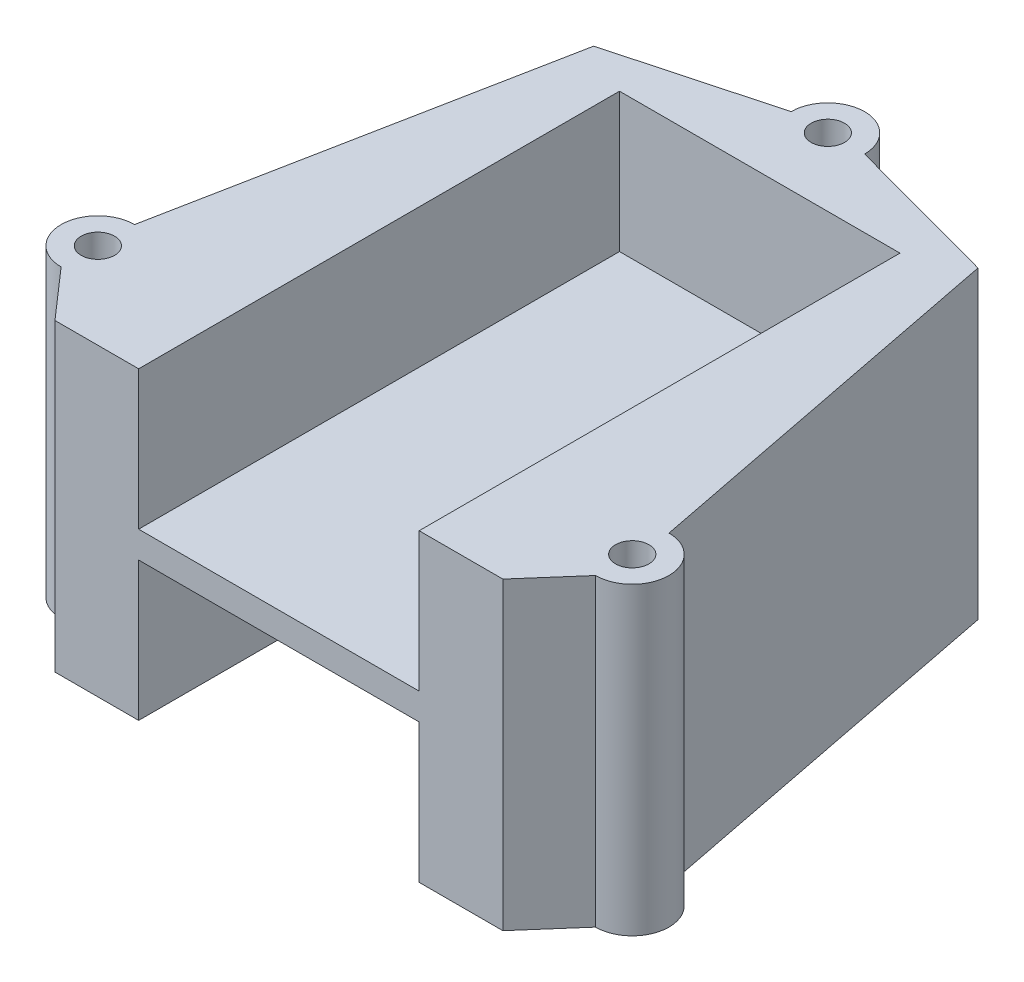
ISO-10303-21;
HEADER;
FILE_DESCRIPTION(('STEP AP214'),'2;1');
FILE_NAME('part.step','',(''),(''),'','','');
FILE_SCHEMA(('AUTOMOTIVE_DESIGN { 1 0 10303 214 1 1 1 1 }'));
ENDSEC;
DATA;
#1=APPLICATION_CONTEXT('core data for automotive mechanical design processes');
#2=APPLICATION_PROTOCOL_DEFINITION('international standard','automotive_design',2000,#1);
#3=PRODUCT_CONTEXT('',#1,'mechanical');
#4=PRODUCT('Part','Part','',(#3));
#5=PRODUCT_RELATED_PRODUCT_CATEGORY('part','',(#4));
#6=PRODUCT_DEFINITION_FORMATION('','',#4);
#7=PRODUCT_DEFINITION_CONTEXT('part definition',#1,'design');
#8=PRODUCT_DEFINITION('design','',#6,#7);
#9=PRODUCT_DEFINITION_SHAPE('','',#8);
#10=(LENGTH_UNIT() NAMED_UNIT(*) SI_UNIT(.MILLI.,.METRE.));
#11=(NAMED_UNIT(*) PLANE_ANGLE_UNIT() SI_UNIT($,.RADIAN.));
#12=(NAMED_UNIT(*) SI_UNIT($,.STERADIAN.) SOLID_ANGLE_UNIT());
#13=UNCERTAINTY_MEASURE_WITH_UNIT(LENGTH_MEASURE(1.E-05),#10,'distance_accuracy_value','');
#14=(GEOMETRIC_REPRESENTATION_CONTEXT(3) GLOBAL_UNCERTAINTY_ASSIGNED_CONTEXT((#13)) GLOBAL_UNIT_ASSIGNED_CONTEXT((#10,
#11,#12)) REPRESENTATION_CONTEXT('',''));
#15=CARTESIAN_POINT('',(0.,0.,0.));
#16=DIRECTION('',(0.,0.,1.));
#17=DIRECTION('',(1.,0.,0.));
#18=AXIS2_PLACEMENT_3D('',#15,#16,#17);
#19=CARTESIAN_POINT('',(7.62756429182967,31.496,-28.2193089615794));
#20=DIRECTION('',(-0.260932107471473,0.,0.965357154264936));
#21=DIRECTION('',(0.965357154264936,0.,0.260932107471473));
#22=AXIS2_PLACEMENT_3D('',#19,#20,#21);
#23=PLANE('',#22);
#24=DIRECTION('',(-0.965357154264936,0.,-0.260932107471473));
#25=VECTOR('',#24,1.);
#26=CARTESIAN_POINT('',(7.62756429182967,2.54,-28.2193089615794));
#27=LINE('',#26,#25);
#28=CARTESIAN_POINT('',(18.2707496641315,2.54,-25.342499298819));
#29=VERTEX_POINT('',#28);
#30=CARTESIAN_POINT('',(3.4925,2.54,-29.337));
#31=VERTEX_POINT('',#30);
#32=EDGE_CURVE('E187',#29,#31,#27,.T.);
#33=ORIENTED_EDGE('',*,*,#32,.T.);
#34=DIRECTION('',(0.,-1.,0.));
#35=VECTOR('',#34,1.);
#36=CARTESIAN_POINT('',(3.4925,31.496,-29.337));
#37=LINE('',#36,#35);
#38=CARTESIAN_POINT('',(3.4925,31.496,-29.337));
#39=VERTEX_POINT('',#38);
#40=EDGE_CURVE('E300',#39,#31,#37,.T.);
#41=ORIENTED_EDGE('',*,*,#40,.F.);
#42=DIRECTION('',(-0.965357154264936,0.,-0.260932107471473));
#43=VECTOR('',#42,1.);
#44=CARTESIAN_POINT('',(7.62756429182967,31.496,-28.2193089615794));
#45=LINE('',#44,#43);
#46=CARTESIAN_POINT('',(18.2707496641315,31.496,-25.342499298819));
#47=VERTEX_POINT('',#46);
#48=EDGE_CURVE('E205',#47,#39,#45,.T.);
#49=ORIENTED_EDGE('',*,*,#48,.F.);
#50=DIRECTION('',(0.,-1.,0.));
#51=VECTOR('',#50,1.);
#52=CARTESIAN_POINT('',(18.2707496641315,31.496,-25.342499298819));
#53=LINE('',#52,#51);
#54=EDGE_CURVE('E243',#47,#29,#53,.T.);
#55=ORIENTED_EDGE('',*,*,#54,.T.);
#56=EDGE_LOOP('',(#33,#41,#49,#55));
#57=FACE_BOUND('',#56,.T.);
#58=ADVANCED_FACE('F34',(#57),#23,.F.);
#59=CARTESIAN_POINT('',(0.,31.496,-29.337));
#60=DIRECTION('',(0.,-1.,0.));
#61=DIRECTION('',(0.,0.,-1.));
#62=AXIS2_PLACEMENT_3D('',#59,#60,#61);
#63=CYLINDRICAL_SURFACE('',#62,3.4925);
#64=CARTESIAN_POINT('',(0.,2.54,-29.337));
#65=DIRECTION('',(0.,1.,0.));
#66=DIRECTION('',(0.,0.,1.));
#67=AXIS2_PLACEMENT_3D('',#64,#65,#66);
#68=CIRCLE('',#67,3.4925);
#69=CARTESIAN_POINT('',(-3.4925,2.54,-29.337));
#70=VERTEX_POINT('',#69);
#71=EDGE_CURVE('E246',#31,#70,#68,.T.);
#72=ORIENTED_EDGE('',*,*,#71,.T.);
#73=DIRECTION('',(0.,-1.,0.));
#74=VECTOR('',#73,1.);
#75=CARTESIAN_POINT('',(-3.4925,31.496,-29.337));
#76=LINE('',#75,#74);
#77=CARTESIAN_POINT('',(-3.4925,31.496,-29.337));
#78=VERTEX_POINT('',#77);
#79=EDGE_CURVE('E298',#78,#70,#76,.T.);
#80=ORIENTED_EDGE('',*,*,#79,.F.);
#81=CARTESIAN_POINT('',(0.,31.496,-29.337));
#82=DIRECTION('',(0.,1.,0.));
#83=DIRECTION('',(0.,0.,1.));
#84=AXIS2_PLACEMENT_3D('',#81,#82,#83);
#85=CIRCLE('',#84,3.4925);
#86=EDGE_CURVE('E208',#39,#78,#85,.T.);
#87=ORIENTED_EDGE('',*,*,#86,.F.);
#88=ORIENTED_EDGE('',*,*,#40,.T.);
#89=EDGE_LOOP('',(#72,#80,#87,#88));
#90=FACE_BOUND('',#89,.T.);
#91=ADVANCED_FACE('F365',(#90),#63,.T.);
#92=CARTESIAN_POINT('',(-7.62756429182967,31.496,-28.2193089615794));
#93=DIRECTION('',(-0.260932107471473,0.,-0.965357154264936));
#94=DIRECTION('',(-0.965357154264936,0.,0.260932107471473));
#95=AXIS2_PLACEMENT_3D('',#92,#93,#94);
#96=PLANE('',#95);
#97=DIRECTION('',(0.965357154264936,0.,-0.260932107471473));
#98=VECTOR('',#97,1.);
#99=CARTESIAN_POINT('',(-7.62756429182967,2.54,-28.2193089615794));
#100=LINE('',#99,#98);
#101=CARTESIAN_POINT('',(-18.2707496641315,2.54,-25.342499298819));
#102=VERTEX_POINT('',#101);
#103=EDGE_CURVE('E249',#102,#70,#100,.T.);
#104=ORIENTED_EDGE('',*,*,#103,.F.);
#105=DIRECTION('',(0.,-1.,0.));
#106=VECTOR('',#105,1.);
#107=CARTESIAN_POINT('',(-18.2707496641315,31.496,-25.342499298819));
#108=LINE('',#107,#106);
#109=CARTESIAN_POINT('',(-18.2707496641315,31.496,-25.342499298819));
#110=VERTEX_POINT('',#109);
#111=EDGE_CURVE('E296',#110,#102,#108,.T.);
#112=ORIENTED_EDGE('',*,*,#111,.F.);
#113=DIRECTION('',(0.965357154264936,0.,-0.260932107471473));
#114=VECTOR('',#113,1.);
#115=CARTESIAN_POINT('',(-7.62756429182967,31.496,-28.2193089615794));
#116=LINE('',#115,#114);
#117=EDGE_CURVE('E211',#110,#78,#116,.T.);
#118=ORIENTED_EDGE('',*,*,#117,.T.);
#119=ORIENTED_EDGE('',*,*,#79,.T.);
#120=EDGE_LOOP('',(#104,#112,#118,#119));
#121=FACE_BOUND('',#120,.T.);
#122=ADVANCED_FACE('F370',(#121),#96,.T.);
#123=CARTESIAN_POINT('',(-22.368668171537,31.496,-4.37091300614584));
#124=DIRECTION('',(-0.981438641880801,0.,-0.191776412061467));
#125=DIRECTION('',(-0.191776412061467,0.,0.981438641880801));
#126=AXIS2_PLACEMENT_3D('',#123,#124,#125);
#127=PLANE('',#126);
#128=DIRECTION('',(0.191776412061467,0.,-0.981438641880801));
#129=VECTOR('',#128,1.);
#130=CARTESIAN_POINT('',(-22.368668171537,2.54,-4.37091300614584));
#131=LINE('',#130,#129);
#132=CARTESIAN_POINT('',(-25.4065872708259,2.54,11.1759999999973));
#133=VERTEX_POINT('',#132);
#134=EDGE_CURVE('E252',#133,#102,#131,.T.);
#135=ORIENTED_EDGE('',*,*,#134,.F.);
#136=DIRECTION('',(0.,-1.,0.));
#137=VECTOR('',#136,1.);
#138=CARTESIAN_POINT('',(-25.4065872708259,31.496,11.1759999999973));
#139=LINE('',#138,#137);
#140=CARTESIAN_POINT('',(-25.4065872708259,31.496,11.1759999999973));
#141=VERTEX_POINT('',#140);
#142=EDGE_CURVE('E294',#141,#133,#139,.T.);
#143=ORIENTED_EDGE('',*,*,#142,.F.);
#144=DIRECTION('',(0.191776412061467,0.,-0.981438641880801));
#145=VECTOR('',#144,1.);
#146=CARTESIAN_POINT('',(-22.368668171537,31.496,-4.37091300614584));
#147=LINE('',#146,#145);
#148=EDGE_CURVE('E214',#141,#110,#147,.T.);
#149=ORIENTED_EDGE('',*,*,#148,.T.);
#150=ORIENTED_EDGE('',*,*,#111,.T.);
#151=EDGE_LOOP('',(#135,#143,#149,#150));
#152=FACE_BOUND('',#151,.T.);
#153=ADVANCED_FACE('F406',(#152),#127,.T.);
#154=CARTESIAN_POINT('',(-25.4065872708259,31.496,14.6684999999989));
#155=DIRECTION('',(0.,-1.,0.));
#156=DIRECTION('',(0.,0.,-1.));
#157=AXIS2_PLACEMENT_3D('',#154,#155,#156);
#158=CYLINDRICAL_SURFACE('',#157,3.49250000000161);
#159=CARTESIAN_POINT('',(-25.4065872708259,2.54,14.6684999999989));
#160=DIRECTION('',(0.,1.,0.));
#161=DIRECTION('',(0.,0.,1.));
#162=AXIS2_PLACEMENT_3D('',#159,#160,#161);
#163=CIRCLE('',#162,3.49250000000161);
#164=CARTESIAN_POINT('',(-25.406587270826,2.54,18.1610000000005));
#165=VERTEX_POINT('',#164);
#166=EDGE_CURVE('E255',#165,#133,#163,.F.);
#167=ORIENTED_EDGE('',*,*,#166,.F.);
#168=DIRECTION('',(0.,-1.,0.));
#169=VECTOR('',#168,1.);
#170=CARTESIAN_POINT('',(-25.406587270826,31.496,18.1610000000005));
#171=LINE('',#170,#169);
#172=CARTESIAN_POINT('',(-25.406587270826,31.496,18.1610000000005));
#173=VERTEX_POINT('',#172);
#174=EDGE_CURVE('E292',#173,#165,#171,.T.);
#175=ORIENTED_EDGE('',*,*,#174,.F.);
#176=CARTESIAN_POINT('',(-25.4065872708259,31.496,14.6684999999989));
#177=DIRECTION('',(0.,1.,0.));
#178=DIRECTION('',(0.,0.,1.));
#179=AXIS2_PLACEMENT_3D('',#176,#177,#178);
#180=CIRCLE('',#179,3.49250000000161);
#181=EDGE_CURVE('E217',#173,#141,#180,.F.);
#182=ORIENTED_EDGE('',*,*,#181,.T.);
#183=ORIENTED_EDGE('',*,*,#142,.T.);
#184=EDGE_LOOP('',(#167,#175,#182,#183));
#185=FACE_BOUND('',#184,.T.);
#186=ADVANCED_FACE('F403',(#185),#158,.T.);
#187=CARTESIAN_POINT('',(-23.3901994162581,31.496,20.4655425677233));
#188=DIRECTION('',(0.752590757097938,0.,-0.658488536218173));
#189=DIRECTION('',(-0.658488536218173,0.,-0.752590757097938));
#190=AXIS2_PLACEMENT_3D('',#187,#188,#189);
#191=PLANE('',#190);
#192=DIRECTION('',(0.658488536218173,0.,0.752590757097938));
#193=VECTOR('',#192,1.);
#194=CARTESIAN_POINT('',(-23.3901994162581,2.54,20.4655425677233));
#195=LINE('',#194,#193);
#196=CARTESIAN_POINT('',(-21.2951394454227,2.54,22.86));
#197=VERTEX_POINT('',#196);
#198=EDGE_CURVE('E258',#165,#197,#195,.T.);
#199=ORIENTED_EDGE('',*,*,#198,.T.);
#200=DIRECTION('',(0.,-1.,0.));
#201=VECTOR('',#200,1.);
#202=CARTESIAN_POINT('',(-21.2951394454227,31.496,22.86));
#203=LINE('',#202,#201);
#204=CARTESIAN_POINT('',(-21.2951394454227,31.496,22.86));
#205=VERTEX_POINT('',#204);
#206=EDGE_CURVE('E289',#205,#197,#203,.T.);
#207=ORIENTED_EDGE('',*,*,#206,.F.);
#208=DIRECTION('',(0.658488536218173,0.,0.752590757097938));
#209=VECTOR('',#208,1.);
#210=CARTESIAN_POINT('',(-23.3901994162581,31.496,20.4655425677233));
#211=LINE('',#210,#209);
#212=EDGE_CURVE('E220',#173,#205,#211,.T.);
#213=ORIENTED_EDGE('',*,*,#212,.F.);
#214=ORIENTED_EDGE('',*,*,#174,.T.);
#215=EDGE_LOOP('',(#199,#207,#213,#214));
#216=FACE_BOUND('',#215,.T.);
#217=ADVANCED_FACE('F325',(#216),#191,.F.);
#218=CARTESIAN_POINT('',(0.,31.496,22.86));
#219=DIRECTION('',(0.,0.,1.));
#220=DIRECTION('',(1.,0.,0.));
#221=AXIS2_PLACEMENT_3D('',#218,#219,#220);
#222=PLANE('',#221);
#223=DIRECTION('',(0.,1.,0.));
#224=VECTOR('',#223,1.);
#225=CARTESIAN_POINT('',(13.335,36.068,22.86));
#226=LINE('',#225,#224);
#227=CARTESIAN_POINT('',(13.335,18.288,22.86));
#228=VERTEX_POINT('',#227);
#229=CARTESIAN_POINT('',(13.335,31.496,22.86));
#230=VERTEX_POINT('',#229);
#231=EDGE_CURVE('E181',#228,#230,#226,.T.);
#232=ORIENTED_EDGE('',*,*,#231,.F.);
#233=DIRECTION('',(1.,0.,0.));
#234=VECTOR('',#233,1.);
#235=CARTESIAN_POINT('',(13.335,18.288,22.86));
#236=LINE('',#235,#234);
#237=CARTESIAN_POINT('',(-13.335,18.288,22.86));
#238=VERTEX_POINT('',#237);
#239=EDGE_CURVE('E185',#238,#228,#236,.T.);
#240=ORIENTED_EDGE('',*,*,#239,.F.);
#241=DIRECTION('',(0.,-1.,0.));
#242=VECTOR('',#241,1.);
#243=CARTESIAN_POINT('',(-13.335,36.068,22.86));
#244=LINE('',#243,#242);
#245=CARTESIAN_POINT('',(-13.335,31.496,22.86));
#246=VERTEX_POINT('',#245);
#247=EDGE_CURVE('E171',#246,#238,#244,.T.);
#248=ORIENTED_EDGE('',*,*,#247,.F.);
#249=DIRECTION('',(-1.,0.,0.));
#250=VECTOR('',#249,1.);
#251=CARTESIAN_POINT('',(0.,31.496,22.86));
#252=LINE('',#251,#250);
#253=EDGE_CURVE('E223',#246,#205,#252,.T.);
#254=ORIENTED_EDGE('',*,*,#253,.T.);
#255=ORIENTED_EDGE('',*,*,#206,.T.);
#256=DIRECTION('',(-1.,0.,0.));
#257=VECTOR('',#256,1.);
#258=CARTESIAN_POINT('',(0.,2.54,22.86));
#259=LINE('',#258,#257);
#260=CARTESIAN_POINT('',(-13.335,2.54,22.86));
#261=VERTEX_POINT('',#260);
#262=EDGE_CURVE('E261',#261,#197,#259,.T.);
#263=ORIENTED_EDGE('',*,*,#262,.F.);
#264=DIRECTION('',(0.,-1.,0.));
#265=VECTOR('',#264,1.);
#266=CARTESIAN_POINT('',(-13.335,-2.032,22.86));
#267=LINE('',#266,#265);
#268=CARTESIAN_POINT('',(-13.335,15.748,22.86));
#269=VERTEX_POINT('',#268);
#270=EDGE_CURVE('E192',#269,#261,#267,.T.);
#271=ORIENTED_EDGE('',*,*,#270,.F.);
#272=DIRECTION('',(-1.,0.,0.));
#273=VECTOR('',#272,1.);
#274=CARTESIAN_POINT('',(13.335,15.748,22.86));
#275=LINE('',#274,#273);
#276=CARTESIAN_POINT('',(13.335,15.748,22.86));
#277=VERTEX_POINT('',#276);
#278=EDGE_CURVE('E198',#277,#269,#275,.T.);
#279=ORIENTED_EDGE('',*,*,#278,.F.);
#280=DIRECTION('',(0.,1.,0.));
#281=VECTOR('',#280,1.);
#282=CARTESIAN_POINT('',(13.335,-2.032,22.86));
#283=LINE('',#282,#281);
#284=CARTESIAN_POINT('',(13.335,2.54,22.86));
#285=VERTEX_POINT('',#284);
#286=EDGE_CURVE('E196',#285,#277,#283,.T.);
#287=ORIENTED_EDGE('',*,*,#286,.F.);
#288=CARTESIAN_POINT('',(21.2951394454227,2.54,22.86));
#289=VERTEX_POINT('',#288);
#290=EDGE_CURVE('E262',#289,#285,#259,.T.);
#291=ORIENTED_EDGE('',*,*,#290,.F.);
#292=DIRECTION('',(0.,-1.,0.));
#293=VECTOR('',#292,1.);
#294=CARTESIAN_POINT('',(21.2951394454227,31.496,22.86));
#295=LINE('',#294,#293);
#296=CARTESIAN_POINT('',(21.2951394454227,31.496,22.86));
#297=VERTEX_POINT('',#296);
#298=EDGE_CURVE('E287',#297,#289,#295,.T.);
#299=ORIENTED_EDGE('',*,*,#298,.F.);
#300=EDGE_CURVE('E224',#297,#230,#252,.T.);
#301=ORIENTED_EDGE('',*,*,#300,.T.);
#302=EDGE_LOOP('',(#232,#240,#248,#254,#255,#263,#271,#279,#287,#291,#299,#301));
#303=FACE_BOUND('',#302,.T.);
#304=ADVANCED_FACE('F316',(#303),#222,.T.);
#305=CARTESIAN_POINT('',(23.3901994162581,31.496,20.4655425677234));
#306=DIRECTION('',(0.752590757097937,0.,0.658488536218175));
#307=DIRECTION('',(0.658488536218175,0.,-0.752590757097937));
#308=AXIS2_PLACEMENT_3D('',#305,#306,#307);
#309=PLANE('',#308);
#310=DIRECTION('',(-0.658488536218175,0.,0.752590757097937));
#311=VECTOR('',#310,1.);
#312=CARTESIAN_POINT('',(23.3901994162581,2.54,20.4655425677234));
#313=LINE('',#312,#311);
#314=CARTESIAN_POINT('',(25.4065872708259,2.54,18.1610000000005));
#315=VERTEX_POINT('',#314);
#316=EDGE_CURVE('E265',#315,#289,#313,.T.);
#317=ORIENTED_EDGE('',*,*,#316,.F.);
#318=DIRECTION('',(0.,-1.,0.));
#319=VECTOR('',#318,1.);
#320=CARTESIAN_POINT('',(25.4065872708259,31.496,18.1610000000005));
#321=LINE('',#320,#319);
#322=CARTESIAN_POINT('',(25.4065872708259,31.496,18.1610000000005));
#323=VERTEX_POINT('',#322);
#324=EDGE_CURVE('E285',#323,#315,#321,.T.);
#325=ORIENTED_EDGE('',*,*,#324,.F.);
#326=DIRECTION('',(-0.658488536218175,0.,0.752590757097937));
#327=VECTOR('',#326,1.);
#328=CARTESIAN_POINT('',(23.3901994162581,31.496,20.4655425677234));
#329=LINE('',#328,#327);
#330=EDGE_CURVE('E227',#323,#297,#329,.T.);
#331=ORIENTED_EDGE('',*,*,#330,.T.);
#332=ORIENTED_EDGE('',*,*,#298,.T.);
#333=EDGE_LOOP('',(#317,#325,#331,#332));
#334=FACE_BOUND('',#333,.T.);
#335=ADVANCED_FACE('F347',(#334),#309,.T.);
#336=CARTESIAN_POINT('',(25.4065872708259,31.496,14.6684999999989));
#337=DIRECTION('',(0.,-1.,0.));
#338=DIRECTION('',(0.,0.,-1.));
#339=AXIS2_PLACEMENT_3D('',#336,#337,#338);
#340=CYLINDRICAL_SURFACE('',#339,3.49250000000161);
#341=CARTESIAN_POINT('',(25.4065872708259,2.54,14.6684999999989));
#342=DIRECTION('',(0.,1.,0.));
#343=DIRECTION('',(0.,0.,1.));
#344=AXIS2_PLACEMENT_3D('',#341,#342,#343);
#345=CIRCLE('',#344,3.49250000000161);
#346=CARTESIAN_POINT('',(25.4065872708259,2.54,11.1759999999973));
#347=VERTEX_POINT('',#346);
#348=EDGE_CURVE('E268',#315,#347,#345,.T.);
#349=ORIENTED_EDGE('',*,*,#348,.T.);
#350=DIRECTION('',(0.,-1.,0.));
#351=VECTOR('',#350,1.);
#352=CARTESIAN_POINT('',(25.4065872708259,31.496,11.1759999999973));
#353=LINE('',#352,#351);
#354=CARTESIAN_POINT('',(25.4065872708259,31.496,11.1759999999973));
#355=VERTEX_POINT('',#354);
#356=EDGE_CURVE('E282',#355,#347,#353,.T.);
#357=ORIENTED_EDGE('',*,*,#356,.F.);
#358=CARTESIAN_POINT('',(25.4065872708259,31.496,14.6684999999989));
#359=DIRECTION('',(0.,1.,0.));
#360=DIRECTION('',(0.,0.,1.));
#361=AXIS2_PLACEMENT_3D('',#358,#359,#360);
#362=CIRCLE('',#361,3.49250000000161);
#363=EDGE_CURVE('E230',#323,#355,#362,.T.);
#364=ORIENTED_EDGE('',*,*,#363,.F.);
#365=ORIENTED_EDGE('',*,*,#324,.T.);
#366=EDGE_LOOP('',(#349,#357,#364,#365));
#367=FACE_BOUND('',#366,.T.);
#368=ADVANCED_FACE('F384',(#367),#340,.T.);
#369=CARTESIAN_POINT('',(-25.4065872708222,31.496,14.6685000000011));
#370=DIRECTION('',(0.,-1.,0.));
#371=DIRECTION('',(0.,0.,-1.));
#372=AXIS2_PLACEMENT_3D('',#369,#370,#371);
#373=CYLINDRICAL_SURFACE('',#372,1.58750000000238);
#374=CARTESIAN_POINT('',(-25.4065872708222,31.496,14.6685000000011));
#375=DIRECTION('',(0.,1.,0.));
#376=DIRECTION('',(0.,0.,1.));
#377=AXIS2_PLACEMENT_3D('',#374,#375,#376);
#378=CIRCLE('',#377,1.58750000000238);
#379=CARTESIAN_POINT('',(-25.4065872708222,31.496,16.2560000000035));
#380=VERTEX_POINT('',#379);
#381=EDGE_CURVE('E237',#380,#380,#378,.F.);
#382=ORIENTED_EDGE('',*,*,#381,.F.);
#383=EDGE_LOOP('',(#382));
#384=FACE_BOUND('',#383,.T.);
#385=CARTESIAN_POINT('',(-25.4065872708222,2.54,14.6685000000011));
#386=DIRECTION('',(0.,1.,0.));
#387=DIRECTION('',(0.,0.,1.));
#388=AXIS2_PLACEMENT_3D('',#385,#386,#387);
#389=CIRCLE('',#388,1.58750000000238);
#390=CARTESIAN_POINT('',(-25.4065872708222,2.54,16.2560000000035));
#391=VERTEX_POINT('',#390);
#392=EDGE_CURVE('E275',#391,#391,#389,.F.);
#393=ORIENTED_EDGE('',*,*,#392,.T.);
#394=EDGE_LOOP('',(#393));
#395=FACE_BOUND('',#394,.T.);
#396=ADVANCED_FACE('F386',(#384,#395),#373,.F.);
#397=CARTESIAN_POINT('',(25.4065872708259,31.496,14.6684999999989));
#398=DIRECTION('',(0.,-1.,0.));
#399=DIRECTION('',(0.,0.,-1.));
#400=AXIS2_PLACEMENT_3D('',#397,#398,#399);
#401=CYLINDRICAL_SURFACE('',#400,1.58750000000161);
#402=CARTESIAN_POINT('',(25.4065872708259,31.496,14.6684999999989));
#403=DIRECTION('',(0.,1.,0.));
#404=DIRECTION('',(0.,0.,1.));
#405=AXIS2_PLACEMENT_3D('',#402,#403,#404);
#406=CIRCLE('',#405,1.58750000000161);
#407=CARTESIAN_POINT('',(25.4065872708259,31.496,16.2560000000005));
#408=VERTEX_POINT('',#407);
#409=EDGE_CURVE('E234',#408,#408,#406,.F.);
#410=ORIENTED_EDGE('',*,*,#409,.F.);
#411=EDGE_LOOP('',(#410));
#412=FACE_BOUND('',#411,.T.);
#413=CARTESIAN_POINT('',(25.4065872708259,2.54,14.6684999999989));
#414=DIRECTION('',(0.,1.,0.));
#415=DIRECTION('',(0.,0.,1.));
#416=AXIS2_PLACEMENT_3D('',#413,#414,#415);
#417=CIRCLE('',#416,1.58750000000161);
#418=CARTESIAN_POINT('',(25.4065872708259,2.54,16.2560000000005));
#419=VERTEX_POINT('',#418);
#420=EDGE_CURVE('E272',#419,#419,#417,.F.);
#421=ORIENTED_EDGE('',*,*,#420,.T.);
#422=EDGE_LOOP('',(#421));
#423=FACE_BOUND('',#422,.T.);
#424=ADVANCED_FACE('F392',(#412,#423),#401,.F.);
#425=CARTESIAN_POINT('',(22.368668171537,31.496,-4.37091300614584));
#426=DIRECTION('',(-0.981438641880801,0.,0.191776412061467));
#427=DIRECTION('',(0.191776412061467,0.,0.981438641880801));
#428=AXIS2_PLACEMENT_3D('',#425,#426,#427);
#429=PLANE('',#428);
#430=DIRECTION('',(-0.191776412061467,0.,-0.981438641880801));
#431=VECTOR('',#430,1.);
#432=CARTESIAN_POINT('',(22.368668171537,2.54,-4.37091300614584));
#433=LINE('',#432,#431);
#434=EDGE_CURVE('E270',#347,#29,#433,.T.);
#435=ORIENTED_EDGE('',*,*,#434,.T.);
#436=ORIENTED_EDGE('',*,*,#54,.F.);
#437=DIRECTION('',(-0.191776412061467,0.,-0.981438641880801));
#438=VECTOR('',#437,1.);
#439=CARTESIAN_POINT('',(22.368668171537,31.496,-4.37091300614584));
#440=LINE('',#439,#438);
#441=EDGE_CURVE('E232',#355,#47,#440,.T.);
#442=ORIENTED_EDGE('',*,*,#441,.F.);
#443=ORIENTED_EDGE('',*,*,#356,.T.);
#444=EDGE_LOOP('',(#435,#436,#442,#443));
#445=FACE_BOUND('',#444,.T.);
#446=ADVANCED_FACE('F382',(#445),#429,.F.);
#447=CARTESIAN_POINT('',(0.,31.496,-29.337));
#448=DIRECTION('',(0.,-1.,0.));
#449=DIRECTION('',(0.,0.,-1.));
#450=AXIS2_PLACEMENT_3D('',#447,#448,#449);
#451=CYLINDRICAL_SURFACE('',#450,1.5875);
#452=CARTESIAN_POINT('',(0.,31.496,-29.337));
#453=DIRECTION('',(0.,1.,0.));
#454=DIRECTION('',(0.,0.,1.));
#455=AXIS2_PLACEMENT_3D('',#452,#453,#454);
#456=CIRCLE('',#455,1.5875);
#457=CARTESIAN_POINT('',(0.,31.496,-27.7495));
#458=VERTEX_POINT('',#457);
#459=EDGE_CURVE('E240',#458,#458,#456,.F.);
#460=ORIENTED_EDGE('',*,*,#459,.F.);
#461=EDGE_LOOP('',(#460));
#462=FACE_BOUND('',#461,.T.);
#463=CARTESIAN_POINT('',(0.,2.54,-29.337));
#464=DIRECTION('',(0.,1.,0.));
#465=DIRECTION('',(0.,0.,1.));
#466=AXIS2_PLACEMENT_3D('',#463,#464,#465);
#467=CIRCLE('',#466,1.5875);
#468=CARTESIAN_POINT('',(0.,2.54,-27.7495));
#469=VERTEX_POINT('',#468);
#470=EDGE_CURVE('E209',#469,#469,#467,.F.);
#471=ORIENTED_EDGE('',*,*,#470,.T.);
#472=EDGE_LOOP('',(#471));
#473=FACE_BOUND('',#472,.T.);
#474=ADVANCED_FACE('F466',(#462,#473),#451,.F.);
#475=CARTESIAN_POINT('',(0.,31.496,0.));
#476=DIRECTION('',(0.,1.,0.));
#477=DIRECTION('',(0.,0.,1.));
#478=AXIS2_PLACEMENT_3D('',#475,#476,#477);
#479=PLANE('',#478);
#480=DIRECTION('',(0.,0.,-1.));
#481=VECTOR('',#480,1.);
#482=CARTESIAN_POINT('',(13.335,31.496,0.));
#483=LINE('',#482,#481);
#484=CARTESIAN_POINT('',(13.335,31.496,-22.86));
#485=VERTEX_POINT('',#484);
#486=EDGE_CURVE('E11',#230,#485,#483,.T.);
#487=ORIENTED_EDGE('',*,*,#486,.F.);
#488=ORIENTED_EDGE('',*,*,#300,.F.);
#489=ORIENTED_EDGE('',*,*,#330,.F.);
#490=ORIENTED_EDGE('',*,*,#363,.T.);
#491=ORIENTED_EDGE('',*,*,#441,.T.);
#492=ORIENTED_EDGE('',*,*,#48,.T.);
#493=ORIENTED_EDGE('',*,*,#86,.T.);
#494=ORIENTED_EDGE('',*,*,#117,.F.);
#495=ORIENTED_EDGE('',*,*,#148,.F.);
#496=ORIENTED_EDGE('',*,*,#181,.F.);
#497=ORIENTED_EDGE('',*,*,#212,.T.);
#498=ORIENTED_EDGE('',*,*,#253,.F.);
#499=DIRECTION('',(0.,0.,1.));
#500=VECTOR('',#499,1.);
#501=CARTESIAN_POINT('',(-13.335,31.496,0.));
#502=LINE('',#501,#500);
#503=CARTESIAN_POINT('',(-13.335,31.496,-22.86));
#504=VERTEX_POINT('',#503);
#505=EDGE_CURVE('E41',#504,#246,#502,.T.);
#506=ORIENTED_EDGE('',*,*,#505,.F.);
#507=DIRECTION('',(-1.,0.,0.));
#508=VECTOR('',#507,1.);
#509=CARTESIAN_POINT('',(0.,31.496,-22.86));
#510=LINE('',#509,#508);
#511=EDGE_CURVE('E163',#485,#504,#510,.T.);
#512=ORIENTED_EDGE('',*,*,#511,.F.);
#513=EDGE_LOOP('',(#487,#488,#489,#490,#491,#492,#493,#494,#495,#496,#497,#498,#506,#512));
#514=FACE_BOUND('',#513,.T.);
#515=ORIENTED_EDGE('',*,*,#409,.T.);
#516=EDGE_LOOP('',(#515));
#517=FACE_BOUND('',#516,.T.);
#518=ORIENTED_EDGE('',*,*,#381,.T.);
#519=EDGE_LOOP('',(#518));
#520=FACE_BOUND('',#519,.T.);
#521=ORIENTED_EDGE('',*,*,#459,.T.);
#522=EDGE_LOOP('',(#521));
#523=FACE_BOUND('',#522,.T.);
#524=ADVANCED_FACE('F318',(#514,#517,#520,#523),#479,.T.);
#525=CARTESIAN_POINT('',(0.,2.54,0.));
#526=DIRECTION('',(0.,1.,0.));
#527=DIRECTION('',(0.,0.,1.));
#528=AXIS2_PLACEMENT_3D('',#525,#526,#527);
#529=PLANE('',#528);
#530=DIRECTION('',(-1.,0.,0.));
#531=VECTOR('',#530,1.);
#532=CARTESIAN_POINT('',(0.,2.54,-22.86));
#533=LINE('',#532,#531);
#534=CARTESIAN_POINT('',(13.335,2.54,-22.86));
#535=VERTEX_POINT('',#534);
#536=CARTESIAN_POINT('',(-13.335,2.54,-22.86));
#537=VERTEX_POINT('',#536);
#538=EDGE_CURVE('E303',#535,#537,#533,.T.);
#539=ORIENTED_EDGE('',*,*,#538,.T.);
#540=DIRECTION('',(0.,0.,1.));
#541=VECTOR('',#540,1.);
#542=CARTESIAN_POINT('',(-13.335,2.54,0.));
#543=LINE('',#542,#541);
#544=EDGE_CURVE('E309',#537,#261,#543,.T.);
#545=ORIENTED_EDGE('',*,*,#544,.T.);
#546=ORIENTED_EDGE('',*,*,#262,.T.);
#547=ORIENTED_EDGE('',*,*,#198,.F.);
#548=ORIENTED_EDGE('',*,*,#166,.T.);
#549=ORIENTED_EDGE('',*,*,#134,.T.);
#550=ORIENTED_EDGE('',*,*,#103,.T.);
#551=ORIENTED_EDGE('',*,*,#71,.F.);
#552=ORIENTED_EDGE('',*,*,#32,.F.);
#553=ORIENTED_EDGE('',*,*,#434,.F.);
#554=ORIENTED_EDGE('',*,*,#348,.F.);
#555=ORIENTED_EDGE('',*,*,#316,.T.);
#556=ORIENTED_EDGE('',*,*,#290,.T.);
#557=DIRECTION('',(0.,0.,-1.));
#558=VECTOR('',#557,1.);
#559=CARTESIAN_POINT('',(13.335,2.54,0.));
#560=LINE('',#559,#558);
#561=EDGE_CURVE('E306',#285,#535,#560,.T.);
#562=ORIENTED_EDGE('',*,*,#561,.T.);
#563=EDGE_LOOP('',(#539,#545,#546,#547,#548,#549,#550,#551,#552,#553,#554,#555,#556,#562));
#564=FACE_BOUND('',#563,.T.);
#565=ORIENTED_EDGE('',*,*,#420,.F.);
#566=EDGE_LOOP('',(#565));
#567=FACE_BOUND('',#566,.T.);
#568=ORIENTED_EDGE('',*,*,#392,.F.);
#569=EDGE_LOOP('',(#568));
#570=FACE_BOUND('',#569,.T.);
#571=ORIENTED_EDGE('',*,*,#470,.F.);
#572=EDGE_LOOP('',(#571));
#573=FACE_BOUND('',#572,.T.);
#574=ADVANCED_FACE('F331',(#564,#567,#570,#573),#529,.F.);
#575=CARTESIAN_POINT('',(-13.335,-2.032,-22.86));
#576=DIRECTION('',(-1.,0.,0.));
#577=DIRECTION('',(0.,-1.,0.));
#578=AXIS2_PLACEMENT_3D('',#575,#576,#577);
#579=PLANE('',#578);
#580=DIRECTION('',(0.,-1.,0.));
#581=VECTOR('',#580,1.);
#582=CARTESIAN_POINT('',(-13.335,-2.032,-22.86));
#583=LINE('',#582,#581);
#584=CARTESIAN_POINT('',(-13.335,15.748,-22.86));
#585=VERTEX_POINT('',#584);
#586=EDGE_CURVE('E55',#585,#537,#583,.T.);
#587=ORIENTED_EDGE('',*,*,#586,.F.);
#588=DIRECTION('',(0.,0.,1.));
#589=VECTOR('',#588,1.);
#590=CARTESIAN_POINT('',(-13.335,15.748,-22.86));
#591=LINE('',#590,#589);
#592=EDGE_CURVE('E183',#585,#269,#591,.T.);
#593=ORIENTED_EDGE('',*,*,#592,.T.);
#594=ORIENTED_EDGE('',*,*,#270,.T.);
#595=ORIENTED_EDGE('',*,*,#544,.F.);
#596=EDGE_LOOP('',(#587,#593,#594,#595));
#597=FACE_BOUND('',#596,.T.);
#598=ADVANCED_FACE('F335',(#597),#579,.F.);
#599=CARTESIAN_POINT('',(13.335,-2.032,-22.86));
#600=DIRECTION('',(1.,0.,0.));
#601=DIRECTION('',(0.,1.,0.));
#602=AXIS2_PLACEMENT_3D('',#599,#600,#601);
#603=PLANE('',#602);
#604=ORIENTED_EDGE('',*,*,#286,.T.);
#605=DIRECTION('',(0.,0.,1.));
#606=VECTOR('',#605,1.);
#607=CARTESIAN_POINT('',(13.335,15.748,-22.86));
#608=LINE('',#607,#606);
#609=CARTESIAN_POINT('',(13.335,15.748,-22.86));
#610=VERTEX_POINT('',#609);
#611=EDGE_CURVE('E195',#610,#277,#608,.T.);
#612=ORIENTED_EDGE('',*,*,#611,.F.);
#613=DIRECTION('',(0.,1.,0.));
#614=VECTOR('',#613,1.);
#615=CARTESIAN_POINT('',(13.335,-2.032,-22.86));
#616=LINE('',#615,#614);
#617=EDGE_CURVE('E189',#535,#610,#616,.T.);
#618=ORIENTED_EDGE('',*,*,#617,.F.);
#619=ORIENTED_EDGE('',*,*,#561,.F.);
#620=EDGE_LOOP('',(#604,#612,#618,#619));
#621=FACE_BOUND('',#620,.T.);
#622=ADVANCED_FACE('F494',(#621),#603,.F.);
#623=CARTESIAN_POINT('',(0.,0.,-22.86));
#624=DIRECTION('',(0.,0.,-1.));
#625=DIRECTION('',(-1.,0.,0.));
#626=AXIS2_PLACEMENT_3D('',#623,#624,#625);
#627=PLANE('',#626);
#628=ORIENTED_EDGE('',*,*,#617,.T.);
#629=DIRECTION('',(-1.,0.,0.));
#630=VECTOR('',#629,1.);
#631=CARTESIAN_POINT('',(13.335,15.748,-22.86));
#632=LINE('',#631,#630);
#633=EDGE_CURVE('E191',#610,#585,#632,.T.);
#634=ORIENTED_EDGE('',*,*,#633,.T.);
#635=ORIENTED_EDGE('',*,*,#586,.T.);
#636=ORIENTED_EDGE('',*,*,#538,.F.);
#637=EDGE_LOOP('',(#628,#634,#635,#636));
#638=FACE_BOUND('',#637,.T.);
#639=ADVANCED_FACE('F360',(#638),#627,.F.);
#640=CARTESIAN_POINT('',(13.335,15.748,-22.86));
#641=DIRECTION('',(0.,1.,0.));
#642=DIRECTION('',(0.,0.,1.));
#643=AXIS2_PLACEMENT_3D('',#640,#641,#642);
#644=PLANE('',#643);
#645=ORIENTED_EDGE('',*,*,#278,.T.);
#646=ORIENTED_EDGE('',*,*,#592,.F.);
#647=ORIENTED_EDGE('',*,*,#633,.F.);
#648=ORIENTED_EDGE('',*,*,#611,.T.);
#649=EDGE_LOOP('',(#645,#646,#647,#648));
#650=FACE_BOUND('',#649,.T.);
#651=ADVANCED_FACE('F338',(#650),#644,.F.);
#652=CARTESIAN_POINT('',(13.335,36.068,-22.86));
#653=DIRECTION('',(1.,0.,0.));
#654=DIRECTION('',(0.,1.,0.));
#655=AXIS2_PLACEMENT_3D('',#652,#653,#654);
#656=PLANE('',#655);
#657=ORIENTED_EDGE('',*,*,#486,.T.);
#658=DIRECTION('',(0.,1.,0.));
#659=VECTOR('',#658,1.);
#660=CARTESIAN_POINT('',(13.335,36.068,-22.86));
#661=LINE('',#660,#659);
#662=CARTESIAN_POINT('',(13.335,18.288,-22.86));
#663=VERTEX_POINT('',#662);
#664=EDGE_CURVE('E48',#663,#485,#661,.T.);
#665=ORIENTED_EDGE('',*,*,#664,.F.);
#666=DIRECTION('',(0.,0.,1.));
#667=VECTOR('',#666,1.);
#668=CARTESIAN_POINT('',(13.335,18.288,-22.86));
#669=LINE('',#668,#667);
#670=EDGE_CURVE('E175',#663,#228,#669,.T.);
#671=ORIENTED_EDGE('',*,*,#670,.T.);
#672=ORIENTED_EDGE('',*,*,#231,.T.);
#673=EDGE_LOOP('',(#657,#665,#671,#672));
#674=FACE_BOUND('',#673,.T.);
#675=ADVANCED_FACE('F352',(#674),#656,.F.);
#676=CARTESIAN_POINT('',(13.335,18.288,-22.86));
#677=DIRECTION('',(0.,-1.,0.));
#678=DIRECTION('',(0.,0.,-1.));
#679=AXIS2_PLACEMENT_3D('',#676,#677,#678);
#680=PLANE('',#679);
#681=ORIENTED_EDGE('',*,*,#239,.T.);
#682=ORIENTED_EDGE('',*,*,#670,.F.);
#683=DIRECTION('',(1.,0.,0.));
#684=VECTOR('',#683,1.);
#685=CARTESIAN_POINT('',(13.335,18.288,-22.86));
#686=LINE('',#685,#684);
#687=CARTESIAN_POINT('',(-13.335,18.288,-22.86));
#688=VERTEX_POINT('',#687);
#689=EDGE_CURVE('E161',#688,#663,#686,.T.);
#690=ORIENTED_EDGE('',*,*,#689,.F.);
#691=DIRECTION('',(0.,0.,1.));
#692=VECTOR('',#691,1.);
#693=CARTESIAN_POINT('',(-13.335,18.288,-22.86));
#694=LINE('',#693,#692);
#695=EDGE_CURVE('E168',#688,#238,#694,.T.);
#696=ORIENTED_EDGE('',*,*,#695,.T.);
#697=EDGE_LOOP('',(#681,#682,#690,#696));
#698=FACE_BOUND('',#697,.T.);
#699=ADVANCED_FACE('F177',(#698),#680,.F.);
#700=CARTESIAN_POINT('',(-13.335,36.068,-22.86));
#701=DIRECTION('',(-1.,0.,0.));
#702=DIRECTION('',(0.,-1.,0.));
#703=AXIS2_PLACEMENT_3D('',#700,#701,#702);
#704=PLANE('',#703);
#705=ORIENTED_EDGE('',*,*,#505,.T.);
#706=ORIENTED_EDGE('',*,*,#247,.T.);
#707=ORIENTED_EDGE('',*,*,#695,.F.);
#708=DIRECTION('',(0.,-1.,0.));
#709=VECTOR('',#708,1.);
#710=CARTESIAN_POINT('',(-13.335,36.068,-22.86));
#711=LINE('',#710,#709);
#712=EDGE_CURVE('E157',#504,#688,#711,.T.);
#713=ORIENTED_EDGE('',*,*,#712,.F.);
#714=EDGE_LOOP('',(#705,#706,#707,#713));
#715=FACE_BOUND('',#714,.T.);
#716=ADVANCED_FACE('F169',(#715),#704,.F.);
#717=CARTESIAN_POINT('',(0.,0.,-22.86));
#718=DIRECTION('',(0.,0.,-1.));
#719=DIRECTION('',(-1.,0.,0.));
#720=AXIS2_PLACEMENT_3D('',#717,#718,#719);
#721=PLANE('',#720);
#722=ORIENTED_EDGE('',*,*,#511,.T.);
#723=ORIENTED_EDGE('',*,*,#712,.T.);
#724=ORIENTED_EDGE('',*,*,#689,.T.);
#725=ORIENTED_EDGE('',*,*,#664,.T.);
#726=EDGE_LOOP('',(#722,#723,#724,#725));
#727=FACE_BOUND('',#726,.T.);
#728=ADVANCED_FACE('F159',(#727),#721,.F.);
#729=CLOSED_SHELL('',(#58,#91,#122,#153,#186,#217,#304,#335,#368,#396,#424,#446,#474,#524,#574,
#598,#622,#639,#651,#675,#699,#716,#728));
#730=MANIFOLD_SOLID_BREP('B2',#729);
#731=ADVANCED_BREP_SHAPE_REPRESENTATION('',(#18,#730),#14);
#732=SHAPE_DEFINITION_REPRESENTATION(#9,#731);
ENDSEC;
END-ISO-10303-21;
